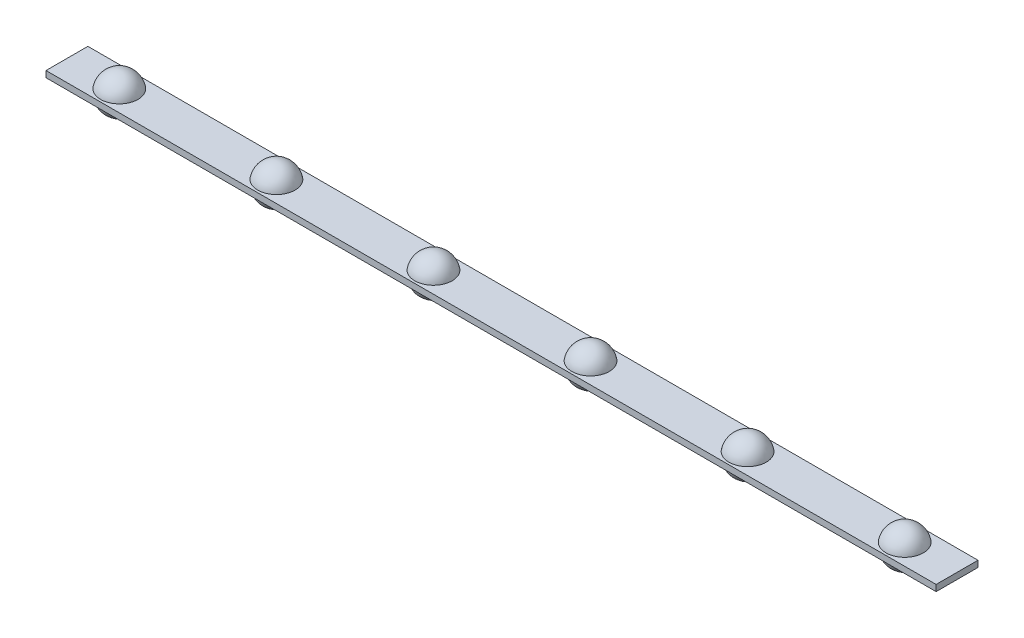
ISO-10303-21;
HEADER;
FILE_DESCRIPTION(('STEP AP214'),'2;1');
FILE_NAME('part.step','',(''),(''),'','','');
FILE_SCHEMA(('AUTOMOTIVE_DESIGN { 1 0 10303 214 1 1 1 1 }'));
ENDSEC;
DATA;
#1=APPLICATION_CONTEXT('core data for automotive mechanical design processes');
#2=APPLICATION_PROTOCOL_DEFINITION('international standard','automotive_design',2000,#1);
#3=PRODUCT_CONTEXT('',#1,'mechanical');
#4=PRODUCT('Part','Part','',(#3));
#5=PRODUCT_RELATED_PRODUCT_CATEGORY('part','',(#4));
#6=PRODUCT_DEFINITION_FORMATION('','',#4);
#7=PRODUCT_DEFINITION_CONTEXT('part definition',#1,'design');
#8=PRODUCT_DEFINITION('design','',#6,#7);
#9=PRODUCT_DEFINITION_SHAPE('','',#8);
#10=(LENGTH_UNIT() NAMED_UNIT(*) SI_UNIT(.MILLI.,.METRE.));
#11=(NAMED_UNIT(*) PLANE_ANGLE_UNIT() SI_UNIT($,.RADIAN.));
#12=(NAMED_UNIT(*) SI_UNIT($,.STERADIAN.) SOLID_ANGLE_UNIT());
#13=UNCERTAINTY_MEASURE_WITH_UNIT(LENGTH_MEASURE(1.E-05),#10,'distance_accuracy_value','');
#14=(GEOMETRIC_REPRESENTATION_CONTEXT(3) GLOBAL_UNCERTAINTY_ASSIGNED_CONTEXT((#13)) GLOBAL_UNIT_ASSIGNED_CONTEXT((#10,
#11,#12)) REPRESENTATION_CONTEXT('',''));
#15=CARTESIAN_POINT('',(0.,0.,0.));
#16=DIRECTION('',(0.,0.,1.));
#17=DIRECTION('',(1.,0.,0.));
#18=AXIS2_PLACEMENT_3D('',#15,#16,#17);
#19=CARTESIAN_POINT('',(-365.125,13.7451343630532,2.7686));
#20=DIRECTION('',(0.,1.,0.));
#21=DIRECTION('',(0.,0.,1.));
#22=AXIS2_PLACEMENT_3D('',#19,#20,#21);
#23=SPHERICAL_SURFACE('',#22,2.29870000495187);
#24=CARTESIAN_POINT('',(-365.125,13.3641343630532,2.7686));
#25=DIRECTION('',(0.,1.,0.));
#26=DIRECTION('',(0.,0.,1.));
#27=AXIS2_PLACEMENT_3D('',#24,#25,#26);
#28=CIRCLE('',#27,2.26690553679807);
#29=CARTESIAN_POINT('',(-365.125,13.3641343630532,5.03550553679807));
#30=VERTEX_POINT('',#29);
#31=EDGE_CURVE('E120',#30,#30,#28,.T.);
#32=ORIENTED_EDGE('',*,*,#31,.F.);
#33=EDGE_LOOP('',(#32));
#34=FACE_BOUND('',#33,.T.);
#35=ADVANCED_FACE('F36',(#34),#23,.T.);
#36=CARTESIAN_POINT('',(-371.475,14.1261343630532,0.2286));
#37=DIRECTION('',(0.,0.,1.));
#38=DIRECTION('',(0.,-1.,0.));
#39=AXIS2_PLACEMENT_3D('',#36,#37,#38);
#40=PLANE('',#39);
#41=DIRECTION('',(1.,0.,0.));
#42=VECTOR('',#41,1.);
#43=CARTESIAN_POINT('',(-371.475,14.1261343630532,0.2286));
#44=LINE('',#43,#42);
#45=CARTESIAN_POINT('',(-371.475,14.1261343630532,0.2286));
#46=VERTEX_POINT('',#45);
#47=CARTESIAN_POINT('',(-263.525,14.1261343630532,0.2286));
#48=VERTEX_POINT('',#47);
#49=EDGE_CURVE('E100',#46,#48,#44,.T.);
#50=ORIENTED_EDGE('',*,*,#49,.T.);
#51=DIRECTION('',(0.,-1.,0.));
#52=VECTOR('',#51,1.);
#53=CARTESIAN_POINT('',(-263.525,14.1261343630532,0.2286));
#54=LINE('',#53,#52);
#55=CARTESIAN_POINT('',(-263.525,13.3641343630532,0.228600000000001));
#56=VERTEX_POINT('',#55);
#57=EDGE_CURVE('E94',#48,#56,#54,.T.);
#58=ORIENTED_EDGE('',*,*,#57,.T.);
#59=DIRECTION('',(1.,0.,0.));
#60=VECTOR('',#59,1.);
#61=CARTESIAN_POINT('',(-371.475,13.3641343630532,0.228600000000001));
#62=LINE('',#61,#60);
#63=CARTESIAN_POINT('',(-371.475,13.3641343630532,0.228600000000001));
#64=VERTEX_POINT('',#63);
#65=EDGE_CURVE('E77',#64,#56,#62,.T.);
#66=ORIENTED_EDGE('',*,*,#65,.F.);
#67=DIRECTION('',(0.,-1.,0.));
#68=VECTOR('',#67,1.);
#69=CARTESIAN_POINT('',(-371.475,14.1261343630532,0.2286));
#70=LINE('',#69,#68);
#71=EDGE_CURVE('E109',#46,#64,#70,.T.);
#72=ORIENTED_EDGE('',*,*,#71,.F.);
#73=EDGE_LOOP('',(#50,#58,#66,#72));
#74=FACE_BOUND('',#73,.T.);
#75=ADVANCED_FACE('F99',(#74),#40,.F.);
#76=CARTESIAN_POINT('',(-371.475,13.3641343630532,0.228600000000001));
#77=DIRECTION('',(0.,1.,0.));
#78=DIRECTION('',(0.,0.,1.));
#79=AXIS2_PLACEMENT_3D('',#76,#77,#78);
#80=PLANE('',#79);
#81=CARTESIAN_POINT('',(-269.875,13.3641343630532,2.7686));
#82=DIRECTION('',(0.,1.,0.));
#83=DIRECTION('',(0.,0.,1.));
#84=AXIS2_PLACEMENT_3D('',#81,#82,#83);
#85=CIRCLE('',#84,2.26690553679807);
#86=CARTESIAN_POINT('',(-269.875,13.3641343630532,5.03550553679807));
#87=VERTEX_POINT('',#86);
#88=EDGE_CURVE('E11',#87,#87,#85,.F.);
#89=ORIENTED_EDGE('',*,*,#88,.F.);
#90=EDGE_LOOP('',(#89));
#91=FACE_BOUND('',#90,.T.);
#92=CARTESIAN_POINT('',(-288.925,13.3641343630532,2.7686));
#93=DIRECTION('',(0.,1.,0.));
#94=DIRECTION('',(0.,0.,1.));
#95=AXIS2_PLACEMENT_3D('',#92,#93,#94);
#96=CIRCLE('',#95,2.26690553679807);
#97=CARTESIAN_POINT('',(-288.925,13.3641343630532,5.03550553679807));
#98=VERTEX_POINT('',#97);
#99=EDGE_CURVE('E135',#98,#98,#96,.F.);
#100=ORIENTED_EDGE('',*,*,#99,.F.);
#101=EDGE_LOOP('',(#100));
#102=FACE_BOUND('',#101,.T.);
#103=CARTESIAN_POINT('',(-307.975,13.3641343630532,2.7686));
#104=DIRECTION('',(0.,1.,0.));
#105=DIRECTION('',(0.,0.,1.));
#106=AXIS2_PLACEMENT_3D('',#103,#104,#105);
#107=CIRCLE('',#106,2.26690553679807);
#108=CARTESIAN_POINT('',(-307.975,13.3641343630532,5.03550553679807));
#109=VERTEX_POINT('',#108);
#110=EDGE_CURVE('E132',#109,#109,#107,.F.);
#111=ORIENTED_EDGE('',*,*,#110,.F.);
#112=EDGE_LOOP('',(#111));
#113=FACE_BOUND('',#112,.T.);
#114=CARTESIAN_POINT('',(-327.025,13.3641343630532,2.7686));
#115=DIRECTION('',(0.,1.,0.));
#116=DIRECTION('',(0.,0.,1.));
#117=AXIS2_PLACEMENT_3D('',#114,#115,#116);
#118=CIRCLE('',#117,2.26690553679807);
#119=CARTESIAN_POINT('',(-327.025,13.3641343630532,5.03550553679807));
#120=VERTEX_POINT('',#119);
#121=EDGE_CURVE('E129',#120,#120,#118,.F.);
#122=ORIENTED_EDGE('',*,*,#121,.F.);
#123=EDGE_LOOP('',(#122));
#124=FACE_BOUND('',#123,.T.);
#125=CARTESIAN_POINT('',(-346.075,13.3641343630532,2.7686));
#126=DIRECTION('',(0.,1.,0.));
#127=DIRECTION('',(0.,0.,1.));
#128=AXIS2_PLACEMENT_3D('',#125,#126,#127);
#129=CIRCLE('',#128,2.26690553679807);
#130=CARTESIAN_POINT('',(-346.075,13.3641343630532,5.03550553679807));
#131=VERTEX_POINT('',#130);
#132=EDGE_CURVE('E103',#131,#131,#129,.F.);
#133=ORIENTED_EDGE('',*,*,#132,.F.);
#134=EDGE_LOOP('',(#133));
#135=FACE_BOUND('',#134,.T.);
#136=ORIENTED_EDGE('',*,*,#31,.T.);
#137=EDGE_LOOP('',(#136));
#138=FACE_BOUND('',#137,.T.);
#139=ORIENTED_EDGE('',*,*,#65,.T.);
#140=DIRECTION('',(0.,0.,1.));
#141=VECTOR('',#140,1.);
#142=CARTESIAN_POINT('',(-263.525,13.3641343630532,0.228600000000001));
#143=LINE('',#142,#141);
#144=CARTESIAN_POINT('',(-263.525,13.3641343630532,5.3086));
#145=VERTEX_POINT('',#144);
#146=EDGE_CURVE('E81',#56,#145,#143,.T.);
#147=ORIENTED_EDGE('',*,*,#146,.T.);
#148=DIRECTION('',(1.,0.,0.));
#149=VECTOR('',#148,1.);
#150=CARTESIAN_POINT('',(-371.475,13.3641343630532,5.3086));
#151=LINE('',#150,#149);
#152=CARTESIAN_POINT('',(-371.475,13.3641343630532,5.3086));
#153=VERTEX_POINT('',#152);
#154=EDGE_CURVE('E87',#153,#145,#151,.T.);
#155=ORIENTED_EDGE('',*,*,#154,.F.);
#156=DIRECTION('',(0.,0.,1.));
#157=VECTOR('',#156,1.);
#158=CARTESIAN_POINT('',(-371.475,13.3641343630532,0.228600000000001));
#159=LINE('',#158,#157);
#160=EDGE_CURVE('E82',#64,#153,#159,.T.);
#161=ORIENTED_EDGE('',*,*,#160,.F.);
#162=EDGE_LOOP('',(#139,#147,#155,#161));
#163=FACE_BOUND('',#162,.T.);
#164=ADVANCED_FACE('F79',(#91,#102,#113,#124,#135,#138,#163),#80,.F.);
#165=CARTESIAN_POINT('',(-371.475,14.1261343630532,5.3086));
#166=DIRECTION('',(0.,0.,-1.));
#167=DIRECTION('',(0.,1.,0.));
#168=AXIS2_PLACEMENT_3D('',#165,#166,#167);
#169=PLANE('',#168);
#170=ORIENTED_EDGE('',*,*,#154,.T.);
#171=DIRECTION('',(0.,1.,0.));
#172=VECTOR('',#171,1.);
#173=CARTESIAN_POINT('',(-263.525,14.1261343630532,5.3086));
#174=LINE('',#173,#172);
#175=CARTESIAN_POINT('',(-263.525,14.1261343630532,5.3086));
#176=VERTEX_POINT('',#175);
#177=EDGE_CURVE('E97',#145,#176,#174,.T.);
#178=ORIENTED_EDGE('',*,*,#177,.T.);
#179=DIRECTION('',(1.,0.,0.));
#180=VECTOR('',#179,1.);
#181=CARTESIAN_POINT('',(-371.475,14.1261343630532,5.3086));
#182=LINE('',#181,#180);
#183=CARTESIAN_POINT('',(-371.475,14.1261343630532,5.3086));
#184=VERTEX_POINT('',#183);
#185=EDGE_CURVE('E115',#184,#176,#182,.T.);
#186=ORIENTED_EDGE('',*,*,#185,.F.);
#187=DIRECTION('',(0.,1.,0.));
#188=VECTOR('',#187,1.);
#189=CARTESIAN_POINT('',(-371.475,14.1261343630532,5.3086));
#190=LINE('',#189,#188);
#191=EDGE_CURVE('E56',#153,#184,#190,.T.);
#192=ORIENTED_EDGE('',*,*,#191,.F.);
#193=EDGE_LOOP('',(#170,#178,#186,#192));
#194=FACE_BOUND('',#193,.T.);
#195=ADVANCED_FACE('F151',(#194),#169,.F.);
#196=CARTESIAN_POINT('',(-371.475,14.1261343630532,0.2286));
#197=DIRECTION('',(0.,-1.,0.));
#198=DIRECTION('',(0.,0.,-1.));
#199=AXIS2_PLACEMENT_3D('',#196,#197,#198);
#200=PLANE('',#199);
#201=CARTESIAN_POINT('',(-269.875,14.1261343630532,2.7686));
#202=DIRECTION('',(0.,-1.,0.));
#203=DIRECTION('',(0.,0.,-1.));
#204=AXIS2_PLACEMENT_3D('',#201,#202,#203);
#205=CIRCLE('',#204,2.26690553679807);
#206=CARTESIAN_POINT('',(-269.875,14.1261343630532,0.50169446320193));
#207=VERTEX_POINT('',#206);
#208=EDGE_CURVE('E39',#207,#207,#205,.F.);
#209=ORIENTED_EDGE('',*,*,#208,.F.);
#210=EDGE_LOOP('',(#209));
#211=FACE_BOUND('',#210,.T.);
#212=CARTESIAN_POINT('',(-288.925,14.1261343630532,2.7686));
#213=DIRECTION('',(0.,-1.,0.));
#214=DIRECTION('',(0.,0.,-1.));
#215=AXIS2_PLACEMENT_3D('',#212,#213,#214);
#216=CIRCLE('',#215,2.26690553679807);
#217=CARTESIAN_POINT('',(-288.925,14.1261343630532,0.50169446320193));
#218=VERTEX_POINT('',#217);
#219=EDGE_CURVE('E133',#218,#218,#216,.F.);
#220=ORIENTED_EDGE('',*,*,#219,.F.);
#221=EDGE_LOOP('',(#220));
#222=FACE_BOUND('',#221,.T.);
#223=CARTESIAN_POINT('',(-307.975,14.1261343630532,2.7686));
#224=DIRECTION('',(0.,-1.,0.));
#225=DIRECTION('',(0.,0.,-1.));
#226=AXIS2_PLACEMENT_3D('',#223,#224,#225);
#227=CIRCLE('',#226,2.26690553679807);
#228=CARTESIAN_POINT('',(-307.975,14.1261343630532,0.50169446320193));
#229=VERTEX_POINT('',#228);
#230=EDGE_CURVE('E130',#229,#229,#227,.F.);
#231=ORIENTED_EDGE('',*,*,#230,.F.);
#232=EDGE_LOOP('',(#231));
#233=FACE_BOUND('',#232,.T.);
#234=CARTESIAN_POINT('',(-327.025,14.1261343630532,2.7686));
#235=DIRECTION('',(0.,-1.,0.));
#236=DIRECTION('',(0.,0.,-1.));
#237=AXIS2_PLACEMENT_3D('',#234,#235,#236);
#238=CIRCLE('',#237,2.26690553679807);
#239=CARTESIAN_POINT('',(-327.025,14.1261343630532,0.50169446320193));
#240=VERTEX_POINT('',#239);
#241=EDGE_CURVE('E126',#240,#240,#238,.F.);
#242=ORIENTED_EDGE('',*,*,#241,.F.);
#243=EDGE_LOOP('',(#242));
#244=FACE_BOUND('',#243,.T.);
#245=CARTESIAN_POINT('',(-346.075,14.1261343630532,2.7686));
#246=DIRECTION('',(0.,-1.,0.));
#247=DIRECTION('',(0.,0.,-1.));
#248=AXIS2_PLACEMENT_3D('',#245,#246,#247);
#249=CIRCLE('',#248,2.26690553679807);
#250=CARTESIAN_POINT('',(-346.075,14.1261343630532,0.50169446320193));
#251=VERTEX_POINT('',#250);
#252=EDGE_CURVE('E123',#251,#251,#249,.F.);
#253=ORIENTED_EDGE('',*,*,#252,.F.);
#254=EDGE_LOOP('',(#253));
#255=FACE_BOUND('',#254,.T.);
#256=CARTESIAN_POINT('',(-365.125,14.1261343630532,2.7686));
#257=DIRECTION('',(0.,-1.,0.));
#258=DIRECTION('',(0.,0.,-1.));
#259=AXIS2_PLACEMENT_3D('',#256,#257,#258);
#260=CIRCLE('',#259,2.26690553679807);
#261=CARTESIAN_POINT('',(-365.125,14.1261343630532,0.50169446320193));
#262=VERTEX_POINT('',#261);
#263=EDGE_CURVE('E86',#262,#262,#260,.T.);
#264=ORIENTED_EDGE('',*,*,#263,.T.);
#265=EDGE_LOOP('',(#264));
#266=FACE_BOUND('',#265,.T.);
#267=ORIENTED_EDGE('',*,*,#185,.T.);
#268=DIRECTION('',(0.,0.,-1.));
#269=VECTOR('',#268,1.);
#270=CARTESIAN_POINT('',(-263.525,14.1261343630532,0.2286));
#271=LINE('',#270,#269);
#272=EDGE_CURVE('E107',#176,#48,#271,.T.);
#273=ORIENTED_EDGE('',*,*,#272,.T.);
#274=ORIENTED_EDGE('',*,*,#49,.F.);
#275=DIRECTION('',(0.,0.,-1.));
#276=VECTOR('',#275,1.);
#277=CARTESIAN_POINT('',(-371.475,14.1261343630532,0.2286));
#278=LINE('',#277,#276);
#279=EDGE_CURVE('E51',#184,#46,#278,.T.);
#280=ORIENTED_EDGE('',*,*,#279,.F.);
#281=EDGE_LOOP('',(#267,#273,#274,#280));
#282=FACE_BOUND('',#281,.T.);
#283=ADVANCED_FACE('F178',(#211,#222,#233,#244,#255,#266,#282),#200,.F.);
#284=CARTESIAN_POINT('',(-371.475,13.3641343630532,0.228600000000001));
#285=DIRECTION('',(-1.,0.,0.));
#286=DIRECTION('',(0.,0.,1.));
#287=AXIS2_PLACEMENT_3D('',#284,#285,#286);
#288=PLANE('',#287);
#289=ORIENTED_EDGE('',*,*,#71,.T.);
#290=ORIENTED_EDGE('',*,*,#160,.T.);
#291=ORIENTED_EDGE('',*,*,#191,.T.);
#292=ORIENTED_EDGE('',*,*,#279,.T.);
#293=EDGE_LOOP('',(#289,#290,#291,#292));
#294=FACE_BOUND('',#293,.T.);
#295=ADVANCED_FACE('F174',(#294),#288,.T.);
#296=CARTESIAN_POINT('',(-263.525,13.3641343630532,0.228600000000001));
#297=DIRECTION('',(-1.,0.,0.));
#298=DIRECTION('',(0.,0.,1.));
#299=AXIS2_PLACEMENT_3D('',#296,#297,#298);
#300=PLANE('',#299);
#301=ORIENTED_EDGE('',*,*,#57,.F.);
#302=ORIENTED_EDGE('',*,*,#272,.F.);
#303=ORIENTED_EDGE('',*,*,#177,.F.);
#304=ORIENTED_EDGE('',*,*,#146,.F.);
#305=EDGE_LOOP('',(#301,#302,#303,#304));
#306=FACE_BOUND('',#305,.T.);
#307=ADVANCED_FACE('F92',(#306),#300,.F.);
#308=ORIENTED_EDGE('',*,*,#263,.F.);
#309=EDGE_LOOP('',(#308));
#310=FACE_BOUND('',#309,.T.);
#311=ADVANCED_FACE('F160',(#310),#23,.T.);
#312=CARTESIAN_POINT('',(-346.075,13.7451343630532,2.7686));
#313=DIRECTION('',(0.,1.,0.));
#314=DIRECTION('',(0.,0.,1.));
#315=AXIS2_PLACEMENT_3D('',#312,#313,#314);
#316=SPHERICAL_SURFACE('',#315,2.29870000495187);
#317=ORIENTED_EDGE('',*,*,#252,.T.);
#318=EDGE_LOOP('',(#317));
#319=FACE_BOUND('',#318,.T.);
#320=ADVANCED_FACE('F165',(#319),#316,.T.);
#321=ORIENTED_EDGE('',*,*,#132,.T.);
#322=EDGE_LOOP('',(#321));
#323=FACE_BOUND('',#322,.T.);
#324=ADVANCED_FACE('F171',(#323),#316,.T.);
#325=CARTESIAN_POINT('',(-327.025,13.7451343630532,2.7686));
#326=DIRECTION('',(0.,1.,0.));
#327=DIRECTION('',(0.,0.,1.));
#328=AXIS2_PLACEMENT_3D('',#325,#326,#327);
#329=SPHERICAL_SURFACE('',#328,2.29870000495187);
#330=ORIENTED_EDGE('',*,*,#241,.T.);
#331=EDGE_LOOP('',(#330));
#332=FACE_BOUND('',#331,.T.);
#333=ADVANCED_FACE('F192',(#332),#329,.T.);
#334=ORIENTED_EDGE('',*,*,#121,.T.);
#335=EDGE_LOOP('',(#334));
#336=FACE_BOUND('',#335,.T.);
#337=ADVANCED_FACE('F147',(#336),#329,.T.);
#338=CARTESIAN_POINT('',(-307.975,13.7451343630532,2.7686));
#339=DIRECTION('',(0.,1.,0.));
#340=DIRECTION('',(0.,0.,1.));
#341=AXIS2_PLACEMENT_3D('',#338,#339,#340);
#342=SPHERICAL_SURFACE('',#341,2.29870000495187);
#343=ORIENTED_EDGE('',*,*,#230,.T.);
#344=EDGE_LOOP('',(#343));
#345=FACE_BOUND('',#344,.T.);
#346=ADVANCED_FACE('F196',(#345),#342,.T.);
#347=ORIENTED_EDGE('',*,*,#110,.T.);
#348=EDGE_LOOP('',(#347));
#349=FACE_BOUND('',#348,.T.);
#350=ADVANCED_FACE('F197',(#349),#342,.T.);
#351=CARTESIAN_POINT('',(-288.925,13.7451343630532,2.7686));
#352=DIRECTION('',(0.,1.,0.));
#353=DIRECTION('',(0.,0.,1.));
#354=AXIS2_PLACEMENT_3D('',#351,#352,#353);
#355=SPHERICAL_SURFACE('',#354,2.29870000495187);
#356=ORIENTED_EDGE('',*,*,#219,.T.);
#357=EDGE_LOOP('',(#356));
#358=FACE_BOUND('',#357,.T.);
#359=ADVANCED_FACE('F200',(#358),#355,.T.);
#360=ORIENTED_EDGE('',*,*,#99,.T.);
#361=EDGE_LOOP('',(#360));
#362=FACE_BOUND('',#361,.T.);
#363=ADVANCED_FACE('F201',(#362),#355,.T.);
#364=CARTESIAN_POINT('',(-269.875,13.7451343630532,2.7686));
#365=DIRECTION('',(0.,1.,0.));
#366=DIRECTION('',(0.,0.,1.));
#367=AXIS2_PLACEMENT_3D('',#364,#365,#366);
#368=SPHERICAL_SURFACE('',#367,2.29870000495187);
#369=ORIENTED_EDGE('',*,*,#208,.T.);
#370=EDGE_LOOP('',(#369));
#371=FACE_BOUND('',#370,.T.);
#372=ADVANCED_FACE('F204',(#371),#368,.T.);
#373=ORIENTED_EDGE('',*,*,#88,.T.);
#374=EDGE_LOOP('',(#373));
#375=FACE_BOUND('',#374,.T.);
#376=ADVANCED_FACE('F206',(#375),#368,.T.);
#377=CLOSED_SHELL('',(#35,#75,#164,#195,#283,#295,#307,#311,#320,#324,#333,#337,#346,#350,#359,
#363,#372,#376));
#378=MANIFOLD_SOLID_BREP('B2',#377);
#379=ADVANCED_BREP_SHAPE_REPRESENTATION('',(#18,#378),#14);
#380=SHAPE_DEFINITION_REPRESENTATION(#9,#379);
ENDSEC;
END-ISO-10303-21;
